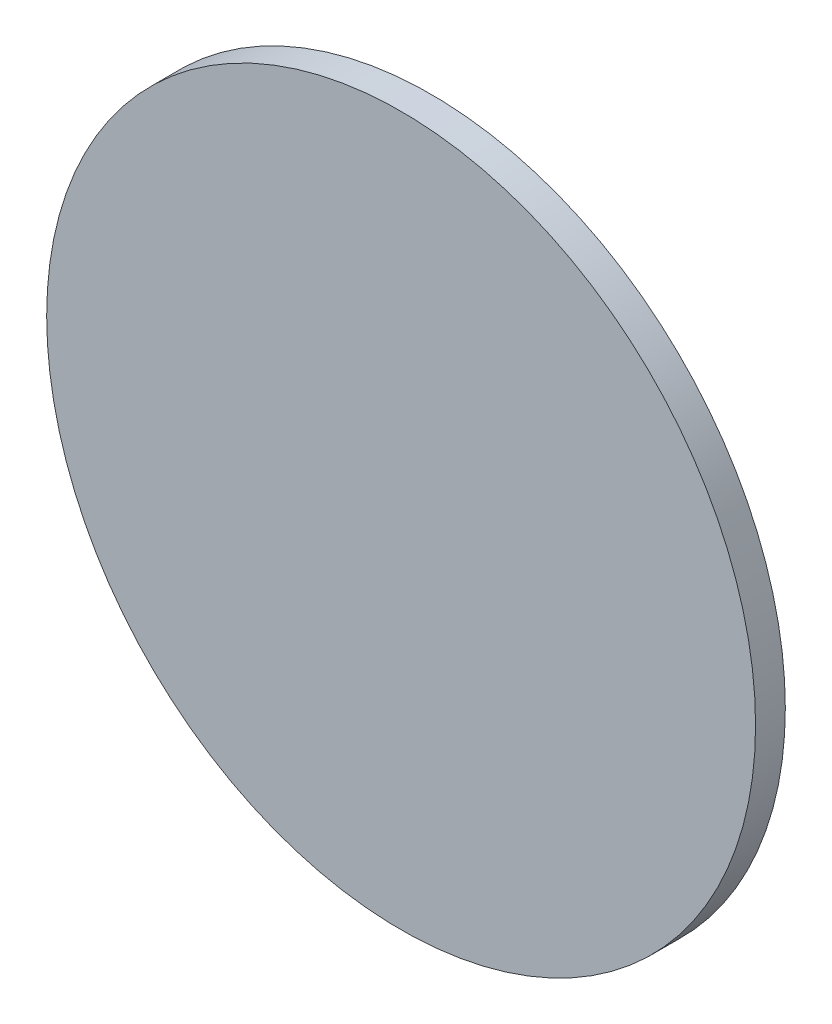
ISO-10303-21;
HEADER;
FILE_DESCRIPTION(('STEP AP214'),'2;1');
FILE_NAME('part.step','',(''),(''),'','','');
FILE_SCHEMA(('AUTOMOTIVE_DESIGN { 1 0 10303 214 1 1 1 1 }'));
ENDSEC;
DATA;
#1=APPLICATION_CONTEXT('core data for automotive mechanical design processes');
#2=APPLICATION_PROTOCOL_DEFINITION('international standard','automotive_design',2000,#1);
#3=PRODUCT_CONTEXT('',#1,'mechanical');
#4=PRODUCT('Part','Part','',(#3));
#5=PRODUCT_RELATED_PRODUCT_CATEGORY('part','',(#4));
#6=PRODUCT_DEFINITION_FORMATION('','',#4);
#7=PRODUCT_DEFINITION_CONTEXT('part definition',#1,'design');
#8=PRODUCT_DEFINITION('design','',#6,#7);
#9=PRODUCT_DEFINITION_SHAPE('','',#8);
#10=(LENGTH_UNIT() NAMED_UNIT(*) SI_UNIT(.MILLI.,.METRE.));
#11=(NAMED_UNIT(*) PLANE_ANGLE_UNIT() SI_UNIT($,.RADIAN.));
#12=(NAMED_UNIT(*) SI_UNIT($,.STERADIAN.) SOLID_ANGLE_UNIT());
#13=UNCERTAINTY_MEASURE_WITH_UNIT(LENGTH_MEASURE(1.E-05),#10,'distance_accuracy_value','');
#14=(GEOMETRIC_REPRESENTATION_CONTEXT(3) GLOBAL_UNCERTAINTY_ASSIGNED_CONTEXT((#13)) GLOBAL_UNIT_ASSIGNED_CONTEXT((#10,
#11,#12)) REPRESENTATION_CONTEXT('',''));
#15=CARTESIAN_POINT('',(0.,0.,0.));
#16=DIRECTION('',(0.,0.,1.));
#17=DIRECTION('',(1.,0.,0.));
#18=AXIS2_PLACEMENT_3D('',#15,#16,#17);
#19=CARTESIAN_POINT('',(0.,0.,1.05));
#20=DIRECTION('',(0.,0.,-1.));
#21=DIRECTION('',(-1.,0.,0.));
#22=AXIS2_PLACEMENT_3D('',#19,#20,#21);
#23=CYLINDRICAL_SURFACE('',#22,12.5);
#24=CARTESIAN_POINT('',(0.,0.,1.05));
#25=DIRECTION('',(0.,0.,1.));
#26=DIRECTION('',(1.,0.,0.));
#27=AXIS2_PLACEMENT_3D('',#24,#25,#26);
#28=CIRCLE('',#27,12.5);
#29=CARTESIAN_POINT('',(12.5,0.,1.05));
#30=VERTEX_POINT('',#29);
#31=EDGE_CURVE('E10',#30,#30,#28,.T.);
#32=ORIENTED_EDGE('',*,*,#31,.F.);
#33=EDGE_LOOP('',(#32));
#34=FACE_BOUND('',#33,.T.);
#35=CARTESIAN_POINT('',(0.,0.,0.));
#36=DIRECTION('',(0.,0.,1.));
#37=DIRECTION('',(1.,0.,0.));
#38=AXIS2_PLACEMENT_3D('',#35,#36,#37);
#39=CIRCLE('',#38,12.5);
#40=CARTESIAN_POINT('',(12.5,0.,0.));
#41=VERTEX_POINT('',#40);
#42=EDGE_CURVE('E38',#41,#41,#39,.T.);
#43=ORIENTED_EDGE('',*,*,#42,.T.);
#44=EDGE_LOOP('',(#43));
#45=FACE_BOUND('',#44,.T.);
#46=ADVANCED_FACE('F35',(#34,#45),#23,.T.);
#47=CARTESIAN_POINT('',(0.,0.,1.05));
#48=DIRECTION('',(0.,0.,1.));
#49=DIRECTION('',(1.,0.,0.));
#50=AXIS2_PLACEMENT_3D('',#47,#48,#49);
#51=PLANE('',#50);
#52=ORIENTED_EDGE('',*,*,#31,.T.);
#53=EDGE_LOOP('',(#52));
#54=FACE_BOUND('',#53,.T.);
#55=ADVANCED_FACE('F50',(#54),#51,.T.);
#56=CARTESIAN_POINT('',(0.,0.,0.));
#57=DIRECTION('',(0.,0.,1.));
#58=DIRECTION('',(1.,0.,0.));
#59=AXIS2_PLACEMENT_3D('',#56,#57,#58);
#60=PLANE('',#59);
#61=ORIENTED_EDGE('',*,*,#42,.F.);
#62=EDGE_LOOP('',(#61));
#63=FACE_BOUND('',#62,.T.);
#64=ADVANCED_FACE('F48',(#63),#60,.F.);
#65=CLOSED_SHELL('',(#46,#55,#64));
#66=MANIFOLD_SOLID_BREP('B2',#65);
#67=ADVANCED_BREP_SHAPE_REPRESENTATION('',(#18,#66),#14);
#68=SHAPE_DEFINITION_REPRESENTATION(#9,#67);
ENDSEC;
END-ISO-10303-21;
